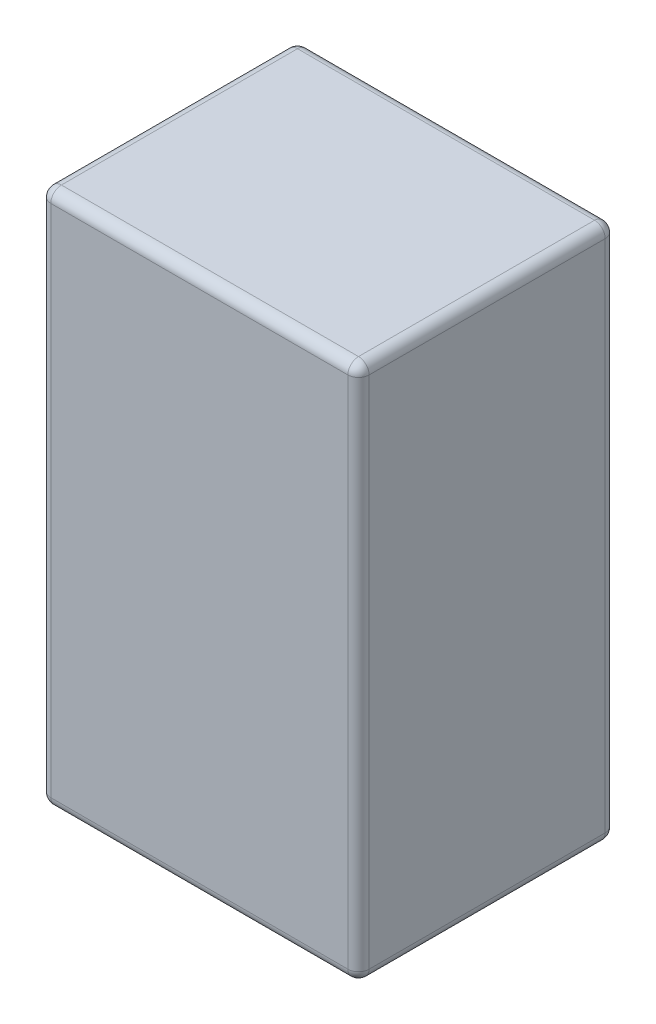
ISO-10303-21;
HEADER;
FILE_DESCRIPTION(('STEP AP214'),'2;1');
FILE_NAME('part.step','',(''),(''),'','','');
FILE_SCHEMA(('AUTOMOTIVE_DESIGN { 1 0 10303 214 1 1 1 1 }'));
ENDSEC;
DATA;
#1=APPLICATION_CONTEXT('core data for automotive mechanical design processes');
#2=APPLICATION_PROTOCOL_DEFINITION('international standard','automotive_design',2000,#1);
#3=PRODUCT_CONTEXT('',#1,'mechanical');
#4=PRODUCT('Part','Part','',(#3));
#5=PRODUCT_RELATED_PRODUCT_CATEGORY('part','',(#4));
#6=PRODUCT_DEFINITION_FORMATION('','',#4);
#7=PRODUCT_DEFINITION_CONTEXT('part definition',#1,'design');
#8=PRODUCT_DEFINITION('design','',#6,#7);
#9=PRODUCT_DEFINITION_SHAPE('','',#8);
#10=(LENGTH_UNIT() NAMED_UNIT(*) SI_UNIT(.MILLI.,.METRE.));
#11=(NAMED_UNIT(*) PLANE_ANGLE_UNIT() SI_UNIT($,.RADIAN.));
#12=(NAMED_UNIT(*) SI_UNIT($,.STERADIAN.) SOLID_ANGLE_UNIT());
#13=UNCERTAINTY_MEASURE_WITH_UNIT(LENGTH_MEASURE(1.E-05),#10,'distance_accuracy_value','');
#14=(GEOMETRIC_REPRESENTATION_CONTEXT(3) GLOBAL_UNCERTAINTY_ASSIGNED_CONTEXT((#13)) GLOBAL_UNIT_ASSIGNED_CONTEXT((#10,
#11,#12)) REPRESENTATION_CONTEXT('',''));
#15=CARTESIAN_POINT('',(0.,0.,0.));
#16=DIRECTION('',(0.,0.,1.));
#17=DIRECTION('',(1.,0.,0.));
#18=AXIS2_PLACEMENT_3D('',#15,#16,#17);
#19=CARTESIAN_POINT('',(-60.,202.,48.5));
#20=DIRECTION('',(-1.,0.,0.));
#21=DIRECTION('',(0.,0.,1.));
#22=AXIS2_PLACEMENT_3D('',#19,#20,#21);
#23=PLANE('',#22);
#24=DIRECTION('',(0.,0.,-1.));
#25=VECTOR('',#24,1.);
#26=CARTESIAN_POINT('',(-60.,198.,-48.5));
#27=LINE('',#26,#25);
#28=CARTESIAN_POINT('',(-60.,198.,44.5));
#29=VERTEX_POINT('',#28);
#30=CARTESIAN_POINT('',(-60.,198.,-44.5));
#31=VERTEX_POINT('',#30);
#32=EDGE_CURVE('E11',#29,#31,#27,.T.);
#33=ORIENTED_EDGE('',*,*,#32,.T.);
#34=DIRECTION('',(0.,-1.,0.));
#35=VECTOR('',#34,1.);
#36=CARTESIAN_POINT('',(-60.,202.,-44.5));
#37=LINE('',#36,#35);
#38=CARTESIAN_POINT('',(-60.,4.,-44.5));
#39=VERTEX_POINT('',#38);
#40=EDGE_CURVE('E27',#31,#39,#37,.T.);
#41=ORIENTED_EDGE('',*,*,#40,.T.);
#42=DIRECTION('',(0.,0.,1.));
#43=VECTOR('',#42,1.);
#44=CARTESIAN_POINT('',(-60.,4.,48.5));
#45=LINE('',#44,#43);
#46=CARTESIAN_POINT('',(-60.,4.,44.5));
#47=VERTEX_POINT('',#46);
#48=EDGE_CURVE('E234',#39,#47,#45,.T.);
#49=ORIENTED_EDGE('',*,*,#48,.T.);
#50=DIRECTION('',(0.,1.,0.));
#51=VECTOR('',#50,1.);
#52=CARTESIAN_POINT('',(-60.,202.,44.5));
#53=LINE('',#52,#51);
#54=EDGE_CURVE('E238',#47,#29,#53,.T.);
#55=ORIENTED_EDGE('',*,*,#54,.T.);
#56=EDGE_LOOP('',(#33,#41,#49,#55));
#57=FACE_BOUND('',#56,.T.);
#58=ADVANCED_FACE('F16',(#57),#23,.T.);
#59=CARTESIAN_POINT('',(-60.,202.,-48.5));
#60=DIRECTION('',(0.,0.,-1.));
#61=DIRECTION('',(0.,-1.,0.));
#62=AXIS2_PLACEMENT_3D('',#59,#60,#61);
#63=PLANE('',#62);
#64=DIRECTION('',(1.,0.,0.));
#65=VECTOR('',#64,1.);
#66=CARTESIAN_POINT('',(60.,198.,-48.5));
#67=LINE('',#66,#65);
#68=CARTESIAN_POINT('',(-56.,198.,-48.5));
#69=VERTEX_POINT('',#68);
#70=CARTESIAN_POINT('',(56.,198.,-48.5));
#71=VERTEX_POINT('',#70);
#72=EDGE_CURVE('E20',#69,#71,#67,.T.);
#73=ORIENTED_EDGE('',*,*,#72,.T.);
#74=DIRECTION('',(0.,-1.,0.));
#75=VECTOR('',#74,1.);
#76=CARTESIAN_POINT('',(56.,202.,-48.5));
#77=LINE('',#76,#75);
#78=CARTESIAN_POINT('',(56.,4.,-48.5));
#79=VERTEX_POINT('',#78);
#80=EDGE_CURVE('E263',#71,#79,#77,.T.);
#81=ORIENTED_EDGE('',*,*,#80,.T.);
#82=DIRECTION('',(-1.,0.,0.));
#83=VECTOR('',#82,1.);
#84=CARTESIAN_POINT('',(-60.,4.,-48.5));
#85=LINE('',#84,#83);
#86=CARTESIAN_POINT('',(-56.,4.,-48.5));
#87=VERTEX_POINT('',#86);
#88=EDGE_CURVE('E252',#79,#87,#85,.T.);
#89=ORIENTED_EDGE('',*,*,#88,.T.);
#90=DIRECTION('',(0.,1.,0.));
#91=VECTOR('',#90,1.);
#92=CARTESIAN_POINT('',(-56.,202.,-48.5));
#93=LINE('',#92,#91);
#94=EDGE_CURVE('E248',#87,#69,#93,.T.);
#95=ORIENTED_EDGE('',*,*,#94,.T.);
#96=EDGE_LOOP('',(#73,#81,#89,#95));
#97=FACE_BOUND('',#96,.T.);
#98=ADVANCED_FACE('F374',(#97),#63,.T.);
#99=CARTESIAN_POINT('',(60.,202.,-48.5));
#100=DIRECTION('',(1.,0.,0.));
#101=DIRECTION('',(0.,1.,0.));
#102=AXIS2_PLACEMENT_3D('',#99,#100,#101);
#103=PLANE('',#102);
#104=DIRECTION('',(0.,0.,-1.));
#105=VECTOR('',#104,1.);
#106=CARTESIAN_POINT('',(60.,4.,-48.5));
#107=LINE('',#106,#105);
#108=CARTESIAN_POINT('',(60.,4.,44.5));
#109=VERTEX_POINT('',#108);
#110=CARTESIAN_POINT('',(60.,4.,-44.5));
#111=VERTEX_POINT('',#110);
#112=EDGE_CURVE('E253',#109,#111,#107,.T.);
#113=ORIENTED_EDGE('',*,*,#112,.T.);
#114=DIRECTION('',(0.,1.,0.));
#115=VECTOR('',#114,1.);
#116=CARTESIAN_POINT('',(60.,202.,-44.5));
#117=LINE('',#116,#115);
#118=CARTESIAN_POINT('',(60.,198.,-44.5));
#119=VERTEX_POINT('',#118);
#120=EDGE_CURVE('E186',#111,#119,#117,.T.);
#121=ORIENTED_EDGE('',*,*,#120,.T.);
#122=DIRECTION('',(0.,0.,1.));
#123=VECTOR('',#122,1.);
#124=CARTESIAN_POINT('',(60.,198.,48.5));
#125=LINE('',#124,#123);
#126=CARTESIAN_POINT('',(60.,198.,44.5));
#127=VERTEX_POINT('',#126);
#128=EDGE_CURVE('E180',#119,#127,#125,.T.);
#129=ORIENTED_EDGE('',*,*,#128,.T.);
#130=DIRECTION('',(0.,-1.,0.));
#131=VECTOR('',#130,1.);
#132=CARTESIAN_POINT('',(60.,202.,44.5));
#133=LINE('',#132,#131);
#134=EDGE_CURVE('E171',#127,#109,#133,.T.);
#135=ORIENTED_EDGE('',*,*,#134,.T.);
#136=EDGE_LOOP('',(#113,#121,#129,#135));
#137=FACE_BOUND('',#136,.T.);
#138=ADVANCED_FACE('F184',(#137),#103,.T.);
#139=CARTESIAN_POINT('',(60.,202.,48.5));
#140=DIRECTION('',(0.,0.,1.));
#141=DIRECTION('',(1.,0.,0.));
#142=AXIS2_PLACEMENT_3D('',#139,#140,#141);
#143=PLANE('',#142);
#144=DIRECTION('',(1.,0.,0.));
#145=VECTOR('',#144,1.);
#146=CARTESIAN_POINT('',(60.,4.,48.5));
#147=LINE('',#146,#145);
#148=CARTESIAN_POINT('',(-56.,4.,48.5));
#149=VERTEX_POINT('',#148);
#150=CARTESIAN_POINT('',(56.,4.,48.5));
#151=VERTEX_POINT('',#150);
#152=EDGE_CURVE('E181',#149,#151,#147,.T.);
#153=ORIENTED_EDGE('',*,*,#152,.T.);
#154=DIRECTION('',(0.,1.,0.));
#155=VECTOR('',#154,1.);
#156=CARTESIAN_POINT('',(56.,202.,48.5));
#157=LINE('',#156,#155);
#158=CARTESIAN_POINT('',(56.,198.,48.5));
#159=VERTEX_POINT('',#158);
#160=EDGE_CURVE('E311',#151,#159,#157,.T.);
#161=ORIENTED_EDGE('',*,*,#160,.T.);
#162=DIRECTION('',(-1.,0.,0.));
#163=VECTOR('',#162,1.);
#164=CARTESIAN_POINT('',(-60.,198.,48.5));
#165=LINE('',#164,#163);
#166=CARTESIAN_POINT('',(-56.,198.,48.5));
#167=VERTEX_POINT('',#166);
#168=EDGE_CURVE('E307',#159,#167,#165,.T.);
#169=ORIENTED_EDGE('',*,*,#168,.T.);
#170=DIRECTION('',(0.,-1.,0.));
#171=VECTOR('',#170,1.);
#172=CARTESIAN_POINT('',(-56.,202.,48.5));
#173=LINE('',#172,#171);
#174=EDGE_CURVE('E241',#167,#149,#173,.T.);
#175=ORIENTED_EDGE('',*,*,#174,.T.);
#176=EDGE_LOOP('',(#153,#161,#169,#175));
#177=FACE_BOUND('',#176,.T.);
#178=ADVANCED_FACE('F394',(#177),#143,.T.);
#179=CARTESIAN_POINT('',(0.,202.,0.));
#180=DIRECTION('',(0.,-1.,0.));
#181=DIRECTION('',(0.,0.,-1.));
#182=AXIS2_PLACEMENT_3D('',#179,#180,#181);
#183=PLANE('',#182);
#184=DIRECTION('',(0.,0.,-1.));
#185=VECTOR('',#184,1.);
#186=CARTESIAN_POINT('',(56.,202.,-48.5));
#187=LINE('',#186,#185);
#188=CARTESIAN_POINT('',(56.,202.,44.5));
#189=VERTEX_POINT('',#188);
#190=CARTESIAN_POINT('',(56.,202.,-44.5));
#191=VERTEX_POINT('',#190);
#192=EDGE_CURVE('E194',#189,#191,#187,.T.);
#193=ORIENTED_EDGE('',*,*,#192,.T.);
#194=DIRECTION('',(-1.,0.,0.));
#195=VECTOR('',#194,1.);
#196=CARTESIAN_POINT('',(-60.,202.,-44.5));
#197=LINE('',#196,#195);
#198=CARTESIAN_POINT('',(-56.,202.,-44.5));
#199=VERTEX_POINT('',#198);
#200=EDGE_CURVE('E242',#191,#199,#197,.T.);
#201=ORIENTED_EDGE('',*,*,#200,.T.);
#202=DIRECTION('',(0.,0.,1.));
#203=VECTOR('',#202,1.);
#204=CARTESIAN_POINT('',(-56.,202.,48.5));
#205=LINE('',#204,#203);
#206=CARTESIAN_POINT('',(-56.,202.,44.5));
#207=VERTEX_POINT('',#206);
#208=EDGE_CURVE('E243',#199,#207,#205,.T.);
#209=ORIENTED_EDGE('',*,*,#208,.T.);
#210=DIRECTION('',(1.,0.,0.));
#211=VECTOR('',#210,1.);
#212=CARTESIAN_POINT('',(60.,202.,44.5));
#213=LINE('',#212,#211);
#214=EDGE_CURVE('E247',#207,#189,#213,.T.);
#215=ORIENTED_EDGE('',*,*,#214,.T.);
#216=EDGE_LOOP('',(#193,#201,#209,#215));
#217=FACE_BOUND('',#216,.T.);
#218=ADVANCED_FACE('F347',(#217),#183,.F.);
#219=CARTESIAN_POINT('',(0.,0.,0.));
#220=DIRECTION('',(0.,-1.,0.));
#221=DIRECTION('',(0.,0.,-1.));
#222=AXIS2_PLACEMENT_3D('',#219,#220,#221);
#223=PLANE('',#222);
#224=DIRECTION('',(0.,0.,-1.));
#225=VECTOR('',#224,1.);
#226=CARTESIAN_POINT('',(-56.,0.,0.));
#227=LINE('',#226,#225);
#228=CARTESIAN_POINT('',(-56.,0.,44.5));
#229=VERTEX_POINT('',#228);
#230=CARTESIAN_POINT('',(-56.,0.,-44.5));
#231=VERTEX_POINT('',#230);
#232=EDGE_CURVE('E288',#229,#231,#227,.T.);
#233=ORIENTED_EDGE('',*,*,#232,.T.);
#234=DIRECTION('',(1.,0.,0.));
#235=VECTOR('',#234,1.);
#236=CARTESIAN_POINT('',(0.,0.,-44.5));
#237=LINE('',#236,#235);
#238=CARTESIAN_POINT('',(56.,0.,-44.5));
#239=VERTEX_POINT('',#238);
#240=EDGE_CURVE('E225',#231,#239,#237,.T.);
#241=ORIENTED_EDGE('',*,*,#240,.T.);
#242=DIRECTION('',(0.,0.,1.));
#243=VECTOR('',#242,1.);
#244=CARTESIAN_POINT('',(56.,0.,0.));
#245=LINE('',#244,#243);
#246=CARTESIAN_POINT('',(56.,0.,44.5));
#247=VERTEX_POINT('',#246);
#248=EDGE_CURVE('E221',#239,#247,#245,.T.);
#249=ORIENTED_EDGE('',*,*,#248,.T.);
#250=DIRECTION('',(-1.,0.,0.));
#251=VECTOR('',#250,1.);
#252=CARTESIAN_POINT('',(0.,0.,44.5));
#253=LINE('',#252,#251);
#254=EDGE_CURVE('E226',#247,#229,#253,.T.);
#255=ORIENTED_EDGE('',*,*,#254,.T.);
#256=EDGE_LOOP('',(#233,#241,#249,#255));
#257=FACE_BOUND('',#256,.T.);
#258=ADVANCED_FACE('F389',(#257),#223,.T.);
#259=CARTESIAN_POINT('',(-56.,202.,44.5));
#260=DIRECTION('',(0.,-1.,0.));
#261=DIRECTION('',(0.,0.,-1.));
#262=AXIS2_PLACEMENT_3D('',#259,#260,#261);
#263=CYLINDRICAL_SURFACE('',#262,4.);
#264=CARTESIAN_POINT('',(-56.,198.,44.5));
#265=DIRECTION('',(0.,1.,0.));
#266=DIRECTION('',(0.,0.,1.));
#267=AXIS2_PLACEMENT_3D('',#264,#265,#266);
#268=CIRCLE('',#267,4.);
#269=EDGE_CURVE('E104',#29,#167,#268,.T.);
#270=ORIENTED_EDGE('',*,*,#269,.F.);
#271=ORIENTED_EDGE('',*,*,#54,.F.);
#272=CARTESIAN_POINT('',(-56.,4.,44.5));
#273=DIRECTION('',(0.,-1.,0.));
#274=DIRECTION('',(0.,0.,-1.));
#275=AXIS2_PLACEMENT_3D('',#272,#273,#274);
#276=CIRCLE('',#275,4.);
#277=EDGE_CURVE('E95',#149,#47,#276,.T.);
#278=ORIENTED_EDGE('',*,*,#277,.F.);
#279=ORIENTED_EDGE('',*,*,#174,.F.);
#280=EDGE_LOOP('',(#270,#271,#278,#279));
#281=FACE_BOUND('',#280,.T.);
#282=ADVANCED_FACE('F391',(#281),#263,.T.);
#283=CARTESIAN_POINT('',(-56.,198.,44.5));
#284=DIRECTION('',(0.,0.,1.));
#285=DIRECTION('',(1.,0.,0.));
#286=AXIS2_PLACEMENT_3D('',#283,#284,#285);
#287=SPHERICAL_SURFACE('',#286,4.);
#288=CARTESIAN_POINT('',(-56.,198.,44.5));
#289=DIRECTION('',(0.,0.,-1.));
#290=DIRECTION('',(1.,0.,0.));
#291=AXIS2_PLACEMENT_3D('',#288,#289,#290);
#292=CIRCLE('',#291,4.);
#293=EDGE_CURVE('E290',#29,#207,#292,.T.);
#294=ORIENTED_EDGE('',*,*,#293,.F.);
#295=ORIENTED_EDGE('',*,*,#269,.T.);
#296=CARTESIAN_POINT('',(-56.,198.,44.5));
#297=DIRECTION('',(1.,0.,0.));
#298=DIRECTION('',(0.,0.,1.));
#299=AXIS2_PLACEMENT_3D('',#296,#297,#298);
#300=CIRCLE('',#299,4.);
#301=EDGE_CURVE('E220',#207,#167,#300,.T.);
#302=ORIENTED_EDGE('',*,*,#301,.F.);
#303=EDGE_LOOP('',(#294,#295,#302));
#304=FACE_BOUND('',#303,.T.);
#305=ADVANCED_FACE('F643',(#304),#287,.T.);
#306=CARTESIAN_POINT('',(-56.,4.,44.5));
#307=DIRECTION('',(0.,0.,1.));
#308=DIRECTION('',(1.,0.,0.));
#309=AXIS2_PLACEMENT_3D('',#306,#307,#308);
#310=SPHERICAL_SURFACE('',#309,4.);
#311=CARTESIAN_POINT('',(-56.,4.,44.5));
#312=DIRECTION('',(1.,0.,0.));
#313=DIRECTION('',(0.,0.,1.));
#314=AXIS2_PLACEMENT_3D('',#311,#312,#313);
#315=CIRCLE('',#314,4.);
#316=EDGE_CURVE('E213',#149,#229,#315,.T.);
#317=ORIENTED_EDGE('',*,*,#316,.F.);
#318=ORIENTED_EDGE('',*,*,#277,.T.);
#319=CARTESIAN_POINT('',(-56.,4.,44.5));
#320=DIRECTION('',(0.,0.,-1.));
#321=DIRECTION('',(1.,0.,0.));
#322=AXIS2_PLACEMENT_3D('',#319,#320,#321);
#323=CIRCLE('',#322,4.);
#324=EDGE_CURVE('E230',#229,#47,#323,.T.);
#325=ORIENTED_EDGE('',*,*,#324,.F.);
#326=EDGE_LOOP('',(#317,#318,#325));
#327=FACE_BOUND('',#326,.T.);
#328=ADVANCED_FACE('F370',(#327),#310,.T.);
#329=CARTESIAN_POINT('',(60.,198.,44.5));
#330=DIRECTION('',(1.,0.,0.));
#331=DIRECTION('',(0.,0.,-1.));
#332=AXIS2_PLACEMENT_3D('',#329,#330,#331);
#333=CYLINDRICAL_SURFACE('',#332,4.);
#334=ORIENTED_EDGE('',*,*,#301,.T.);
#335=ORIENTED_EDGE('',*,*,#168,.F.);
#336=CARTESIAN_POINT('',(56.,198.,44.5));
#337=DIRECTION('',(1.,0.,0.));
#338=DIRECTION('',(0.,0.,-1.));
#339=AXIS2_PLACEMENT_3D('',#336,#337,#338);
#340=CIRCLE('',#339,4.);
#341=EDGE_CURVE('E130',#189,#159,#340,.T.);
#342=ORIENTED_EDGE('',*,*,#341,.F.);
#343=ORIENTED_EDGE('',*,*,#214,.F.);
#344=EDGE_LOOP('',(#334,#335,#342,#343));
#345=FACE_BOUND('',#344,.T.);
#346=ADVANCED_FACE('F360',(#345),#333,.T.);
#347=CARTESIAN_POINT('',(-56.,198.,48.5));
#348=DIRECTION('',(0.,0.,1.));
#349=DIRECTION('',(1.,0.,0.));
#350=AXIS2_PLACEMENT_3D('',#347,#348,#349);
#351=CYLINDRICAL_SURFACE('',#350,4.);
#352=ORIENTED_EDGE('',*,*,#293,.T.);
#353=ORIENTED_EDGE('',*,*,#208,.F.);
#354=CARTESIAN_POINT('',(-56.,198.,-44.5));
#355=DIRECTION('',(0.,0.,-1.));
#356=DIRECTION('',(-1.,0.,0.));
#357=AXIS2_PLACEMENT_3D('',#354,#355,#356);
#358=CIRCLE('',#357,4.);
#359=EDGE_CURVE('E41',#31,#199,#358,.T.);
#360=ORIENTED_EDGE('',*,*,#359,.F.);
#361=ORIENTED_EDGE('',*,*,#32,.F.);
#362=EDGE_LOOP('',(#352,#353,#360,#361));
#363=FACE_BOUND('',#362,.T.);
#364=ADVANCED_FACE('F357',(#363),#351,.T.);
#365=CARTESIAN_POINT('',(-56.,202.,-44.5));
#366=DIRECTION('',(0.,-1.,0.));
#367=DIRECTION('',(0.,0.,-1.));
#368=AXIS2_PLACEMENT_3D('',#365,#366,#367);
#369=CYLINDRICAL_SURFACE('',#368,4.);
#370=CARTESIAN_POINT('',(-56.,4.,-44.5));
#371=DIRECTION('',(0.,-1.,0.));
#372=DIRECTION('',(0.,0.,-1.));
#373=AXIS2_PLACEMENT_3D('',#370,#371,#372);
#374=CIRCLE('',#373,4.);
#375=EDGE_CURVE('E233',#39,#87,#374,.T.);
#376=ORIENTED_EDGE('',*,*,#375,.F.);
#377=ORIENTED_EDGE('',*,*,#40,.F.);
#378=CARTESIAN_POINT('',(-56.,198.,-44.5));
#379=DIRECTION('',(0.,1.,0.));
#380=DIRECTION('',(0.,0.,1.));
#381=AXIS2_PLACEMENT_3D('',#378,#379,#380);
#382=CIRCLE('',#381,4.);
#383=EDGE_CURVE('E168',#69,#31,#382,.T.);
#384=ORIENTED_EDGE('',*,*,#383,.F.);
#385=ORIENTED_EDGE('',*,*,#94,.F.);
#386=EDGE_LOOP('',(#376,#377,#384,#385));
#387=FACE_BOUND('',#386,.T.);
#388=ADVANCED_FACE('F359',(#387),#369,.T.);
#389=CARTESIAN_POINT('',(-56.,4.,0.));
#390=DIRECTION('',(0.,0.,-1.));
#391=DIRECTION('',(-1.,0.,0.));
#392=AXIS2_PLACEMENT_3D('',#389,#390,#391);
#393=CYLINDRICAL_SURFACE('',#392,4.);
#394=ORIENTED_EDGE('',*,*,#324,.T.);
#395=ORIENTED_EDGE('',*,*,#48,.F.);
#396=CARTESIAN_POINT('',(-56.,4.,-44.5));
#397=DIRECTION('',(0.,0.,-1.));
#398=DIRECTION('',(-1.,0.,0.));
#399=AXIS2_PLACEMENT_3D('',#396,#397,#398);
#400=CIRCLE('',#399,4.);
#401=EDGE_CURVE('E142',#231,#39,#400,.T.);
#402=ORIENTED_EDGE('',*,*,#401,.F.);
#403=ORIENTED_EDGE('',*,*,#232,.F.);
#404=EDGE_LOOP('',(#394,#395,#402,#403));
#405=FACE_BOUND('',#404,.T.);
#406=ADVANCED_FACE('F367',(#405),#393,.T.);
#407=CARTESIAN_POINT('',(0.,4.,44.5));
#408=DIRECTION('',(-1.,0.,0.));
#409=DIRECTION('',(0.,0.,1.));
#410=AXIS2_PLACEMENT_3D('',#407,#408,#409);
#411=CYLINDRICAL_SURFACE('',#410,4.);
#412=ORIENTED_EDGE('',*,*,#316,.T.);
#413=ORIENTED_EDGE('',*,*,#254,.F.);
#414=CARTESIAN_POINT('',(56.,4.,44.5));
#415=DIRECTION('',(1.,0.,0.));
#416=DIRECTION('',(0.,0.,-1.));
#417=AXIS2_PLACEMENT_3D('',#414,#415,#416);
#418=CIRCLE('',#417,4.);
#419=EDGE_CURVE('E196',#151,#247,#418,.T.);
#420=ORIENTED_EDGE('',*,*,#419,.F.);
#421=ORIENTED_EDGE('',*,*,#152,.F.);
#422=EDGE_LOOP('',(#412,#413,#420,#421));
#423=FACE_BOUND('',#422,.T.);
#424=ADVANCED_FACE('F402',(#423),#411,.T.);
#425=CARTESIAN_POINT('',(56.,202.,44.5));
#426=DIRECTION('',(0.,-1.,0.));
#427=DIRECTION('',(0.,0.,-1.));
#428=AXIS2_PLACEMENT_3D('',#425,#426,#427);
#429=CYLINDRICAL_SURFACE('',#428,4.);
#430=CARTESIAN_POINT('',(56.,198.,44.5));
#431=DIRECTION('',(0.,1.,0.));
#432=DIRECTION('',(0.,0.,1.));
#433=AXIS2_PLACEMENT_3D('',#430,#431,#432);
#434=CIRCLE('',#433,4.);
#435=EDGE_CURVE('E160',#159,#127,#434,.T.);
#436=ORIENTED_EDGE('',*,*,#435,.F.);
#437=ORIENTED_EDGE('',*,*,#160,.F.);
#438=CARTESIAN_POINT('',(56.,4.,44.5));
#439=DIRECTION('',(0.,-1.,0.));
#440=DIRECTION('',(0.,0.,-1.));
#441=AXIS2_PLACEMENT_3D('',#438,#439,#440);
#442=CIRCLE('',#441,4.);
#443=EDGE_CURVE('E175',#109,#151,#442,.T.);
#444=ORIENTED_EDGE('',*,*,#443,.F.);
#445=ORIENTED_EDGE('',*,*,#134,.F.);
#446=EDGE_LOOP('',(#436,#437,#444,#445));
#447=FACE_BOUND('',#446,.T.);
#448=ADVANCED_FACE('F173',(#447),#429,.T.);
#449=CARTESIAN_POINT('',(56.,198.,44.5));
#450=DIRECTION('',(0.,0.,1.));
#451=DIRECTION('',(1.,0.,0.));
#452=AXIS2_PLACEMENT_3D('',#449,#450,#451);
#453=SPHERICAL_SURFACE('',#452,4.);
#454=ORIENTED_EDGE('',*,*,#341,.T.);
#455=ORIENTED_EDGE('',*,*,#435,.T.);
#456=CARTESIAN_POINT('',(56.,198.,44.5));
#457=DIRECTION('',(0.,0.,-1.));
#458=DIRECTION('',(1.,0.,0.));
#459=AXIS2_PLACEMENT_3D('',#456,#457,#458);
#460=CIRCLE('',#459,4.);
#461=EDGE_CURVE('E164',#189,#127,#460,.T.);
#462=ORIENTED_EDGE('',*,*,#461,.F.);
#463=EDGE_LOOP('',(#454,#455,#462));
#464=FACE_BOUND('',#463,.T.);
#465=ADVANCED_FACE('F162',(#464),#453,.T.);
#466=CARTESIAN_POINT('',(-56.,198.,-44.5));
#467=DIRECTION('',(0.,0.,1.));
#468=DIRECTION('',(1.,0.,0.));
#469=AXIS2_PLACEMENT_3D('',#466,#467,#468);
#470=SPHERICAL_SURFACE('',#469,4.);
#471=ORIENTED_EDGE('',*,*,#383,.T.);
#472=ORIENTED_EDGE('',*,*,#359,.T.);
#473=CARTESIAN_POINT('',(-56.,198.,-44.5));
#474=DIRECTION('',(1.,0.,0.));
#475=DIRECTION('',(0.,0.,1.));
#476=AXIS2_PLACEMENT_3D('',#473,#474,#475);
#477=CIRCLE('',#476,4.);
#478=EDGE_CURVE('E197',#69,#199,#477,.T.);
#479=ORIENTED_EDGE('',*,*,#478,.F.);
#480=EDGE_LOOP('',(#471,#472,#479));
#481=FACE_BOUND('',#480,.T.);
#482=ADVANCED_FACE('F355',(#481),#470,.T.);
#483=CARTESIAN_POINT('',(-56.,4.,-44.5));
#484=DIRECTION('',(0.,0.,1.));
#485=DIRECTION('',(1.,0.,0.));
#486=AXIS2_PLACEMENT_3D('',#483,#484,#485);
#487=SPHERICAL_SURFACE('',#486,4.);
#488=ORIENTED_EDGE('',*,*,#401,.T.);
#489=ORIENTED_EDGE('',*,*,#375,.T.);
#490=CARTESIAN_POINT('',(-56.,4.,-44.5));
#491=DIRECTION('',(1.,0.,0.));
#492=DIRECTION('',(0.,0.,1.));
#493=AXIS2_PLACEMENT_3D('',#490,#491,#492);
#494=CIRCLE('',#493,4.);
#495=EDGE_CURVE('E206',#231,#87,#494,.T.);
#496=ORIENTED_EDGE('',*,*,#495,.F.);
#497=EDGE_LOOP('',(#488,#489,#496));
#498=FACE_BOUND('',#497,.T.);
#499=ADVANCED_FACE('F18',(#498),#487,.T.);
#500=CARTESIAN_POINT('',(56.,4.,44.5));
#501=DIRECTION('',(0.,0.,1.));
#502=DIRECTION('',(1.,0.,0.));
#503=AXIS2_PLACEMENT_3D('',#500,#501,#502);
#504=SPHERICAL_SURFACE('',#503,4.);
#505=ORIENTED_EDGE('',*,*,#443,.T.);
#506=ORIENTED_EDGE('',*,*,#419,.T.);
#507=CARTESIAN_POINT('',(56.,4.,44.5));
#508=DIRECTION('',(0.,0.,-1.));
#509=DIRECTION('',(1.,0.,0.));
#510=AXIS2_PLACEMENT_3D('',#507,#508,#509);
#511=CIRCLE('',#510,4.);
#512=EDGE_CURVE('E257',#109,#247,#511,.T.);
#513=ORIENTED_EDGE('',*,*,#512,.F.);
#514=EDGE_LOOP('',(#505,#506,#513));
#515=FACE_BOUND('',#514,.T.);
#516=ADVANCED_FACE('F565',(#515),#504,.T.);
#517=CARTESIAN_POINT('',(56.,198.,-48.5));
#518=DIRECTION('',(0.,0.,-1.));
#519=DIRECTION('',(-1.,0.,0.));
#520=AXIS2_PLACEMENT_3D('',#517,#518,#519);
#521=CYLINDRICAL_SURFACE('',#520,4.);
#522=ORIENTED_EDGE('',*,*,#461,.T.);
#523=ORIENTED_EDGE('',*,*,#128,.F.);
#524=CARTESIAN_POINT('',(56.,198.,-44.5));
#525=DIRECTION('',(0.,0.,-1.));
#526=DIRECTION('',(-1.,0.,0.));
#527=AXIS2_PLACEMENT_3D('',#524,#525,#526);
#528=CIRCLE('',#527,4.);
#529=EDGE_CURVE('E153',#191,#119,#528,.T.);
#530=ORIENTED_EDGE('',*,*,#529,.F.);
#531=ORIENTED_EDGE('',*,*,#192,.F.);
#532=EDGE_LOOP('',(#522,#523,#530,#531));
#533=FACE_BOUND('',#532,.T.);
#534=ADVANCED_FACE('F192',(#533),#521,.T.);
#535=CARTESIAN_POINT('',(-60.,198.,-44.5));
#536=DIRECTION('',(-1.,0.,0.));
#537=DIRECTION('',(0.,0.,1.));
#538=AXIS2_PLACEMENT_3D('',#535,#536,#537);
#539=CYLINDRICAL_SURFACE('',#538,4.);
#540=ORIENTED_EDGE('',*,*,#478,.T.);
#541=ORIENTED_EDGE('',*,*,#200,.F.);
#542=CARTESIAN_POINT('',(56.,198.,-44.5));
#543=DIRECTION('',(1.,0.,0.));
#544=DIRECTION('',(0.,0.,-1.));
#545=AXIS2_PLACEMENT_3D('',#542,#543,#544);
#546=CIRCLE('',#545,4.);
#547=EDGE_CURVE('E216',#71,#191,#546,.T.);
#548=ORIENTED_EDGE('',*,*,#547,.F.);
#549=ORIENTED_EDGE('',*,*,#72,.F.);
#550=EDGE_LOOP('',(#540,#541,#548,#549));
#551=FACE_BOUND('',#550,.T.);
#552=ADVANCED_FACE('F352',(#551),#539,.T.);
#553=CARTESIAN_POINT('',(0.,4.,-44.5));
#554=DIRECTION('',(1.,0.,0.));
#555=DIRECTION('',(0.,0.,-1.));
#556=AXIS2_PLACEMENT_3D('',#553,#554,#555);
#557=CYLINDRICAL_SURFACE('',#556,4.);
#558=ORIENTED_EDGE('',*,*,#495,.T.);
#559=ORIENTED_EDGE('',*,*,#88,.F.);
#560=CARTESIAN_POINT('',(56.,4.,-44.5));
#561=DIRECTION('',(1.,0.,0.));
#562=DIRECTION('',(0.,0.,-1.));
#563=AXIS2_PLACEMENT_3D('',#560,#561,#562);
#564=CIRCLE('',#563,4.);
#565=EDGE_CURVE('E264',#239,#79,#564,.T.);
#566=ORIENTED_EDGE('',*,*,#565,.F.);
#567=ORIENTED_EDGE('',*,*,#240,.F.);
#568=EDGE_LOOP('',(#558,#559,#566,#567));
#569=FACE_BOUND('',#568,.T.);
#570=ADVANCED_FACE('F405',(#569),#557,.T.);
#571=CARTESIAN_POINT('',(56.,4.,0.));
#572=DIRECTION('',(0.,0.,1.));
#573=DIRECTION('',(1.,0.,0.));
#574=AXIS2_PLACEMENT_3D('',#571,#572,#573);
#575=CYLINDRICAL_SURFACE('',#574,4.);
#576=ORIENTED_EDGE('',*,*,#512,.T.);
#577=ORIENTED_EDGE('',*,*,#248,.F.);
#578=CARTESIAN_POINT('',(56.,4.,-44.5));
#579=DIRECTION('',(0.,0.,-1.));
#580=DIRECTION('',(-1.,0.,0.));
#581=AXIS2_PLACEMENT_3D('',#578,#579,#580);
#582=CIRCLE('',#581,4.);
#583=EDGE_CURVE('E217',#111,#239,#582,.T.);
#584=ORIENTED_EDGE('',*,*,#583,.F.);
#585=ORIENTED_EDGE('',*,*,#112,.F.);
#586=EDGE_LOOP('',(#576,#577,#584,#585));
#587=FACE_BOUND('',#586,.T.);
#588=ADVANCED_FACE('F407',(#587),#575,.T.);
#589=CARTESIAN_POINT('',(56.,198.,-44.5));
#590=DIRECTION('',(0.,0.,1.));
#591=DIRECTION('',(1.,0.,0.));
#592=AXIS2_PLACEMENT_3D('',#589,#590,#591);
#593=SPHERICAL_SURFACE('',#592,4.);
#594=ORIENTED_EDGE('',*,*,#547,.T.);
#595=ORIENTED_EDGE('',*,*,#529,.T.);
#596=CARTESIAN_POINT('',(56.,198.,-44.5));
#597=DIRECTION('',(0.,-1.,0.));
#598=DIRECTION('',(0.,0.,1.));
#599=AXIS2_PLACEMENT_3D('',#596,#597,#598);
#600=CIRCLE('',#599,4.);
#601=EDGE_CURVE('E267',#71,#119,#600,.T.);
#602=ORIENTED_EDGE('',*,*,#601,.F.);
#603=EDGE_LOOP('',(#594,#595,#602));
#604=FACE_BOUND('',#603,.T.);
#605=ADVANCED_FACE('F386',(#604),#593,.T.);
#606=CARTESIAN_POINT('',(56.,4.,-44.5));
#607=DIRECTION('',(0.,0.,1.));
#608=DIRECTION('',(1.,0.,0.));
#609=AXIS2_PLACEMENT_3D('',#606,#607,#608);
#610=SPHERICAL_SURFACE('',#609,4.);
#611=ORIENTED_EDGE('',*,*,#583,.T.);
#612=ORIENTED_EDGE('',*,*,#565,.T.);
#613=CARTESIAN_POINT('',(56.,4.,-44.5));
#614=DIRECTION('',(0.,1.,0.));
#615=DIRECTION('',(0.,0.,-1.));
#616=AXIS2_PLACEMENT_3D('',#613,#614,#615);
#617=CIRCLE('',#616,4.);
#618=EDGE_CURVE('E273',#111,#79,#617,.T.);
#619=ORIENTED_EDGE('',*,*,#618,.F.);
#620=EDGE_LOOP('',(#611,#612,#619));
#621=FACE_BOUND('',#620,.T.);
#622=ADVANCED_FACE('F426',(#621),#610,.T.);
#623=CARTESIAN_POINT('',(56.,202.,-44.5));
#624=DIRECTION('',(0.,-1.,0.));
#625=DIRECTION('',(0.,0.,-1.));
#626=AXIS2_PLACEMENT_3D('',#623,#624,#625);
#627=CYLINDRICAL_SURFACE('',#626,4.);
#628=ORIENTED_EDGE('',*,*,#601,.T.);
#629=ORIENTED_EDGE('',*,*,#120,.F.);
#630=ORIENTED_EDGE('',*,*,#618,.T.);
#631=ORIENTED_EDGE('',*,*,#80,.F.);
#632=EDGE_LOOP('',(#628,#629,#630,#631));
#633=FACE_BOUND('',#632,.T.);
#634=ADVANCED_FACE('F424',(#633),#627,.T.);
#635=CLOSED_SHELL('',(#58,#98,#138,#178,#218,#258,#282,#305,#328,#346,#364,#388,#406,#424,#448,
#465,#482,#499,#516,#534,#552,#570,#588,#605,#622,#634));
#636=MANIFOLD_SOLID_BREP('B1',#635);
#637=ADVANCED_BREP_SHAPE_REPRESENTATION('',(#18,#636),#14);
#638=SHAPE_DEFINITION_REPRESENTATION(#9,#637);
ENDSEC;
END-ISO-10303-21;
